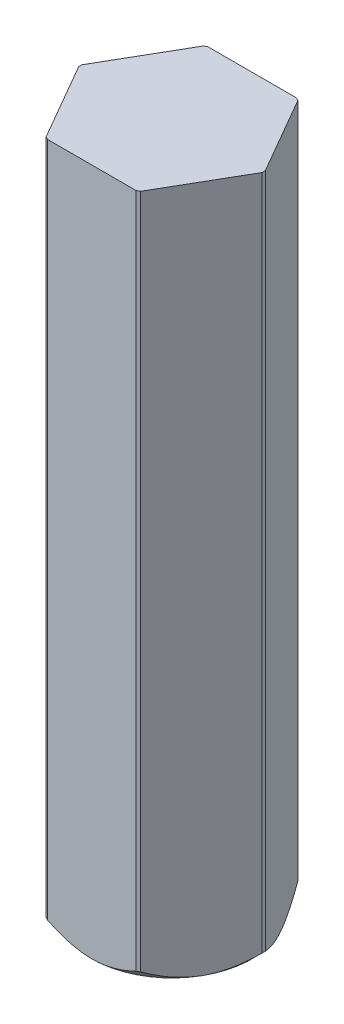
ISO-10303-21;
HEADER;
FILE_DESCRIPTION(('STEP AP214'),'2;1');
FILE_NAME('part.step','',(''),(''),'','','');
FILE_SCHEMA(('AUTOMOTIVE_DESIGN { 1 0 10303 214 1 1 1 1 }'));
ENDSEC;
DATA;
#1=APPLICATION_CONTEXT('core data for automotive mechanical design processes');
#2=APPLICATION_PROTOCOL_DEFINITION('international standard','automotive_design',2000,#1);
#3=PRODUCT_CONTEXT('',#1,'mechanical');
#4=PRODUCT('Part','Part','',(#3));
#5=PRODUCT_RELATED_PRODUCT_CATEGORY('part','',(#4));
#6=PRODUCT_DEFINITION_FORMATION('','',#4);
#7=PRODUCT_DEFINITION_CONTEXT('part definition',#1,'design');
#8=PRODUCT_DEFINITION('design','',#6,#7);
#9=PRODUCT_DEFINITION_SHAPE('','',#8);
#10=(LENGTH_UNIT() NAMED_UNIT(*) SI_UNIT(.MILLI.,.METRE.));
#11=(NAMED_UNIT(*) PLANE_ANGLE_UNIT() SI_UNIT($,.RADIAN.));
#12=(NAMED_UNIT(*) SI_UNIT($,.STERADIAN.) SOLID_ANGLE_UNIT());
#13=UNCERTAINTY_MEASURE_WITH_UNIT(LENGTH_MEASURE(1.E-05),#10,'distance_accuracy_value','');
#14=(GEOMETRIC_REPRESENTATION_CONTEXT(3) GLOBAL_UNCERTAINTY_ASSIGNED_CONTEXT((#13)) GLOBAL_UNIT_ASSIGNED_CONTEXT((#10,
#11,#12)) REPRESENTATION_CONTEXT('',''));
#15=CARTESIAN_POINT('',(0.,0.,0.));
#16=DIRECTION('',(0.,0.,1.));
#17=DIRECTION('',(1.,0.,0.));
#18=AXIS2_PLACEMENT_3D('',#15,#16,#17);
#19=CARTESIAN_POINT('',(0.,35.,0.));
#20=DIRECTION('',(0.,-1.,0.));
#21=DIRECTION('',(0.,0.,-1.));
#22=AXIS2_PLACEMENT_3D('',#19,#20,#21);
#23=CYLINDRICAL_SURFACE('',#22,4.);
#24=DIRECTION('',(0.,-1.,0.));
#25=VECTOR('',#24,1.);
#26=CARTESIAN_POINT('',(-1.93649167310371,35.,3.5));
#27=LINE('',#26,#25);
#28=CARTESIAN_POINT('',(-1.93649167310371,-5.,3.5));
#29=VERTEX_POINT('',#28);
#30=CARTESIAN_POINT('',(-1.93649167310371,-34.5,3.5));
#31=VERTEX_POINT('',#30);
#32=EDGE_CURVE('E318',#29,#31,#27,.T.);
#33=ORIENTED_EDGE('',*,*,#32,.F.);
#34=CARTESIAN_POINT('',(0.,-5.,0.));
#35=DIRECTION('',(0.,1.,0.));
#36=DIRECTION('',(0.,0.,1.));
#37=AXIS2_PLACEMENT_3D('',#34,#35,#36);
#38=CIRCLE('',#37,4.);
#39=CARTESIAN_POINT('',(-2.06284307669368,-5.,3.42705098312484));
#40=VERTEX_POINT('',#39);
#41=EDGE_CURVE('E57',#29,#40,#38,.F.);
#42=ORIENTED_EDGE('',*,*,#41,.T.);
#43=DIRECTION('',(0.,-1.,0.));
#44=VECTOR('',#43,1.);
#45=CARTESIAN_POINT('',(-2.06284307669368,35.,3.42705098312484));
#46=LINE('',#45,#44);
#47=CARTESIAN_POINT('',(-2.06284307669368,-34.5,3.42705098312484));
#48=VERTEX_POINT('',#47);
#49=EDGE_CURVE('E44',#40,#48,#46,.T.);
#50=ORIENTED_EDGE('',*,*,#49,.T.);
#51=CARTESIAN_POINT('',(0.,-34.5,0.));
#52=DIRECTION('',(0.,-1.,0.));
#53=DIRECTION('',(0.,0.,1.));
#54=AXIS2_PLACEMENT_3D('',#51,#52,#53);
#55=CIRCLE('',#54,4.);
#56=EDGE_CURVE('E342',#31,#48,#55,.T.);
#57=ORIENTED_EDGE('',*,*,#56,.F.);
#58=EDGE_LOOP('',(#33,#42,#50,#57));
#59=FACE_BOUND('',#58,.T.);
#60=ADVANCED_FACE('F40',(#59),#23,.T.);
#61=CARTESIAN_POINT('',(-3.03108891324554,35.,1.75));
#62=DIRECTION('',(0.866025403784439,0.,-0.5));
#63=DIRECTION('',(0.,-1.,0.));
#64=AXIS2_PLACEMENT_3D('',#61,#62,#63);
#65=PLANE('',#64);
#66=DIRECTION('',(0.5,0.,0.866025403784439));
#67=VECTOR('',#66,1.);
#68=CARTESIAN_POINT('',(-3.03108891324554,-5.,1.75));
#69=LINE('',#68,#67);
#70=CARTESIAN_POINT('',(-3.99933474979739,-5.,0.0729490168751557));
#71=VERTEX_POINT('',#70);
#72=EDGE_CURVE('E547',#71,#40,#69,.T.);
#73=ORIENTED_EDGE('',*,*,#72,.F.);
#74=DIRECTION('',(0.,-1.,0.));
#75=VECTOR('',#74,1.);
#76=CARTESIAN_POINT('',(-3.99933474979739,35.,0.0729490168751557));
#77=LINE('',#76,#75);
#78=CARTESIAN_POINT('',(-3.99933474979739,-34.5,0.0729490168751558));
#79=VERTEX_POINT('',#78);
#80=EDGE_CURVE('E524',#71,#79,#77,.T.);
#81=ORIENTED_EDGE('',*,*,#80,.T.);
#82=CARTESIAN_POINT('',(-3.03108891324554,-35.,1.75));
#83=CARTESIAN_POINT('',(-3.05882347043528,-35.000012992353,1.70195087477957));
#84=CARTESIAN_POINT('',(-3.08656290483721,-34.9986857060194,1.6539071075598));
#85=CARTESIAN_POINT('',(-3.14205317875729,-34.9934019445432,1.55781783907712));
#86=CARTESIAN_POINT('',(-3.16980388876424,-34.9894392297186,1.50977260493846));
#87=CARTESIAN_POINT('',(-3.22543575008031,-34.9788890801331,1.41346481986221));
#88=CARTESIAN_POINT('',(-3.25331581985047,-34.9722782906641,1.36520421825151));
#89=CARTESIAN_POINT('',(-3.30847097354385,-34.9566808577687,1.26967214797738));
#90=CARTESIAN_POINT('',(-3.33574896907726,-34.9477300402558,1.22239648145921));
#91=CARTESIAN_POINT('',(-3.39033713188932,-34.9274084507866,1.1277987291334));
#92=CARTESIAN_POINT('',(-3.41764536755044,-34.9160165670169,1.08048007530086));
#93=CARTESIAN_POINT('',(-3.47240211435411,-34.890823959931,0.985624830789243));
#94=CARTESIAN_POINT('',(-3.49984709002831,-34.8769912595016,0.938094723864765));
#95=CARTESIAN_POINT('',(-3.55307021121838,-34.8479655583388,0.845894554429295));
#96=CARTESIAN_POINT('',(-3.57886301445262,-34.8328753357736,0.801200440291754));
#97=CARTESIAN_POINT('',(-3.63054121529228,-34.8007004073574,0.711643730418149));
#98=CARTESIAN_POINT('',(-3.65642256025621,-34.7835900201002,0.666788041017114));
#99=CARTESIAN_POINT('',(-3.70835418779817,-34.7473768530761,0.576803546596445));
#100=CARTESIAN_POINT('',(-3.73439941904859,-34.7282442930395,0.531683842656063));
#101=CARTESIAN_POINT('',(-3.78672055298625,-34.6879909826448,0.44106622757434));
#102=CARTESIAN_POINT('',(-3.8129903763939,-34.6668377140399,0.39557928307146));
#103=CARTESIAN_POINT('',(-3.86581274253368,-34.6225458136387,0.304127980921372));
#104=CARTESIAN_POINT('',(-3.89235822934556,-34.599373085296,0.258176115161038));
#105=CARTESIAN_POINT('',(-3.94577519677953,-34.5510406475558,0.165698953480692));
#106=CARTESIAN_POINT('',(-3.97263871730488,-34.5258461551896,0.119187213540123));
#107=CARTESIAN_POINT('',(-3.99933474979739,-34.5,0.0729490168751653));
#108=B_SPLINE_CURVE_WITH_KNOTS('',3,(#82,#83,#84,#85,#86,#87,#88,#89,#90,#91,#92,#93,#94,#95,
#96,#97,#98,#99,#100,#101,#102,#103,#104,#105,#106,#107),.UNSPECIFIED.,.F.,.F.,(4,2,2,2,2,2,2,2,
2,2,2,2,4),(0.,0.166417445521901,0.333230313004929,0.501547972522528,0.667425936371824,
0.834801005707492,1.00455831221987,1.16581653297835,1.3294061767491,1.49587667837163,
1.66573234995728,1.83943197497432,2.01738955955198),.UNSPECIFIED.);
#109=CARTESIAN_POINT('',(-3.03108891324554,-35.,1.75));
#110=VERTEX_POINT('',#109);
#111=EDGE_CURVE('E387',#110,#79,#108,.T.);
#112=ORIENTED_EDGE('',*,*,#111,.F.);
#113=CARTESIAN_POINT('',(-2.06284307669368,-34.5,3.42705098312485));
#114=CARTESIAN_POINT('',(-2.10235976218926,-34.5382590676297,3.35859880058728));
#115=CARTESIAN_POINT('',(-2.14222266408614,-34.5750989658799,3.28952226789693));
#116=CARTESIAN_POINT('',(-2.22131903853511,-34.6441772896961,3.15246272552182));
#117=CARTESIAN_POINT('',(-2.26052767047603,-34.6765297388128,3.08452266503771));
#118=CARTESIAN_POINT('',(-2.33851441025292,-34.7366492821824,2.94943701913404));
#119=CARTESIAN_POINT('',(-2.37727113350339,-34.7645234380977,2.88232705963171));
#120=CARTESIAN_POINT('',(-2.45454889347005,-34.8156827674292,2.7485572686258));
#121=CARTESIAN_POINT('',(-2.49305406478479,-34.8390603897438,2.6819239216714));
#122=CARTESIAN_POINT('',(-2.55282667190896,-34.8718810857713,2.57836353190025));
#123=CARTESIAN_POINT('',(-2.57391726392261,-34.8828045851941,2.54179911961575));
#124=CARTESIAN_POINT('',(-2.61590415847259,-34.9031789680531,2.46896802094185));
#125=CARTESIAN_POINT('',(-2.63679821370228,-34.9126505153656,2.43270585290638));
#126=CARTESIAN_POINT('',(-2.6784596624698,-34.9301177420864,2.36041423925251));
#127=CARTESIAN_POINT('',(-2.69922512799228,-34.938131134779,2.32438797074215));
#128=CARTESIAN_POINT('',(-2.74068543910686,-34.9526868725839,2.25249325967223));
#129=CARTESIAN_POINT('',(-2.76137890788573,-34.959243151391,2.21662685203637));
#130=CARTESIAN_POINT('',(-2.80274748886846,-34.9708881765737,2.14497154289784));
#131=CARTESIAN_POINT('',(-2.82342179710193,-34.9759864505999,2.10918372907991));
#132=CARTESIAN_POINT('',(-2.86479773676806,-34.9847205161798,2.03759875346476));
#133=CARTESIAN_POINT('',(-2.88549907267484,-34.9883609030095,2.00180198265507));
#134=CARTESIAN_POINT('',(-2.92696889475356,-34.9941830482885,1.93010665340676));
#135=CARTESIAN_POINT('',(-2.94773740753644,-34.9963641318886,1.89420805557413));
#136=CARTESIAN_POINT('',(-2.98937260410892,-34.9992775571441,1.8222095910194));
#137=CARTESIAN_POINT('',(-3.01023933738633,-35.0000038442928,1.78610950760279));
#138=CARTESIAN_POINT('',(-3.03108891324554,-35.,1.75));
#139=B_SPLINE_CURVE_WITH_KNOTS('',3,(#113,#114,#115,#116,#117,#118,#119,#120,#121,#122,#123,
#124,#125,#126,#127,#128,#129,#130,#131,#132,#133,#134,#135,#136,#137,#138),.UNSPECIFIED.,.F.,
.F.,(4,2,2,2,2,2,2,2,2,2,2,2,4),(0.,0.263458815209974,0.517939845110757,0.764918588294813,
1.00609323218632,1.13688044266655,1.2655868750523,1.39260674712163,1.51835404040422,
1.64325978427744,1.76776866524313,1.89233508513907,2.01741885174986),.UNSPECIFIED.);
#140=EDGE_CURVE('E376',#48,#110,#139,.T.);
#141=ORIENTED_EDGE('',*,*,#140,.F.);
#142=ORIENTED_EDGE('',*,*,#49,.F.);
#143=EDGE_LOOP('',(#73,#81,#112,#141,#142));
#144=FACE_BOUND('',#143,.T.);
#145=ADVANCED_FACE('F244',(#144),#65,.F.);
#146=CARTESIAN_POINT('',(0.,35.,0.));
#147=DIRECTION('',(0.,-1.,0.));
#148=DIRECTION('',(0.,0.,-1.));
#149=AXIS2_PLACEMENT_3D('',#146,#147,#148);
#150=CYLINDRICAL_SURFACE('',#149,4.);
#151=ORIENTED_EDGE('',*,*,#80,.F.);
#152=CARTESIAN_POINT('',(-3.99933474979739,-5.,-0.0729490168751561));
#153=VERTEX_POINT('',#152);
#154=EDGE_CURVE('E600',#71,#153,#38,.F.);
#155=ORIENTED_EDGE('',*,*,#154,.T.);
#156=DIRECTION('',(0.,-1.,0.));
#157=VECTOR('',#156,1.);
#158=CARTESIAN_POINT('',(-3.99933474979739,35.,-0.0729490168751594));
#159=LINE('',#158,#157);
#160=CARTESIAN_POINT('',(-3.99933474979739,-34.5,-0.0729490168751594));
#161=VERTEX_POINT('',#160);
#162=EDGE_CURVE('E522',#153,#161,#159,.T.);
#163=ORIENTED_EDGE('',*,*,#162,.T.);
#164=CARTESIAN_POINT('',(0.,-34.5,0.));
#165=DIRECTION('',(0.,-1.,0.));
#166=DIRECTION('',(0.,0.,1.));
#167=AXIS2_PLACEMENT_3D('',#164,#165,#166);
#168=CIRCLE('',#167,4.);
#169=EDGE_CURVE('E538',#79,#161,#168,.T.);
#170=ORIENTED_EDGE('',*,*,#169,.F.);
#171=EDGE_LOOP('',(#151,#155,#163,#170));
#172=FACE_BOUND('',#171,.T.);
#173=ADVANCED_FACE('F500',(#172),#150,.T.);
#174=CARTESIAN_POINT('',(-3.03108891324554,35.,-1.75));
#175=DIRECTION('',(0.866025403784439,0.,0.5));
#176=DIRECTION('',(0.,-1.,0.));
#177=AXIS2_PLACEMENT_3D('',#174,#175,#176);
#178=PLANE('',#177);
#179=DIRECTION('',(-0.5,0.,0.866025403784439));
#180=VECTOR('',#179,1.);
#181=CARTESIAN_POINT('',(-3.03108891324554,-5.,-1.75));
#182=LINE('',#181,#180);
#183=CARTESIAN_POINT('',(-2.06284307669368,-5.,-3.42705098312484));
#184=VERTEX_POINT('',#183);
#185=EDGE_CURVE('E588',#184,#153,#182,.T.);
#186=ORIENTED_EDGE('',*,*,#185,.F.);
#187=DIRECTION('',(0.,-1.,0.));
#188=VECTOR('',#187,1.);
#189=CARTESIAN_POINT('',(-2.06284307669368,35.,-3.42705098312484));
#190=LINE('',#189,#188);
#191=CARTESIAN_POINT('',(-2.06284307669368,-34.5,-3.42705098312484));
#192=VERTEX_POINT('',#191);
#193=EDGE_CURVE('E519',#184,#192,#190,.T.);
#194=ORIENTED_EDGE('',*,*,#193,.T.);
#195=CARTESIAN_POINT('',(-3.03108891324554,-35.,-1.75));
#196=CARTESIAN_POINT('',(-3.00334442877006,-35.0000129923529,-1.79804339369915));
#197=CARTESIAN_POINT('',(-2.97560702306524,-34.9986857060194,-1.84608833218758));
#198=CARTESIAN_POINT('',(-2.92013641248821,-34.9934019445432,-1.94218895330652));
#199=CARTESIAN_POINT('',(-2.8924033741968,-34.9894392297187,-1.99024439021491));
#200=CARTESIAN_POINT('',(-2.8368143163967,-34.978889080133,-2.08657688791276));
#201=CARTESIAN_POINT('',(-2.80895944428514,-34.9722782906638,-2.13485203739857));
#202=CARTESIAN_POINT('',(-2.75380382138843,-34.9566808577664,-2.23038383679936));
#203=CARTESIAN_POINT('',(-2.72650089095959,-34.9477300402512,-2.27764510717));
#204=CARTESIAN_POINT('',(-2.67187091569919,-34.9274084507794,-2.37221871908872));
#205=CARTESIAN_POINT('',(-2.6445458772364,-34.9160165670103,-2.4195276718195));
#206=CARTESIAN_POINT('',(-2.58977719921861,-34.8908239599265,-2.51437602782028));
#207=CARTESIAN_POINT('',(-2.56233740702558,-34.8769912594992,-2.56190912740775));
#208=CARTESIAN_POINT('',(-2.50910127866452,-34.8479655583332,-2.65410178714129));
#209=CARTESIAN_POINT('',(-2.48329144203616,-34.8328753357615,-2.69878606705683));
#210=CARTESIAN_POINT('',(-2.43157215662025,-34.8007004073354,-2.78831905676012));
#211=CARTESIAN_POINT('',(-2.40566666257347,-34.783590020075,-2.83316080368989));
#212=CARTESIAN_POINT('',(-2.3537036182245,-34.7473768530463,-2.92312715961982));
#213=CARTESIAN_POINT('',(-2.3276514240243,-34.7282442930086,-2.96824284350235));
#214=CARTESIAN_POINT('',(-2.27533483430013,-34.6879909826139,-3.05886308218772));
#215=CARTESIAN_POINT('',(-2.24907689652383,-34.6668377140103,-3.1043568888608));
#216=CARTESIAN_POINT('',(-2.19628892872484,-34.6225458136139,-3.19582805089198));
#217=CARTESIAN_POINT('',(-2.16976618903338,-34.5993730852748,-3.2417930497005));
#218=CARTESIAN_POINT('',(-2.11638710147309,-34.551040647544,-3.33429208131434));
#219=CARTESIAN_POINT('',(-2.08953851337845,-34.5258461551838,-3.380812442484));
#220=CARTESIAN_POINT('',(-2.06284307669368,-34.5,-3.42705098312484));
#221=B_SPLINE_CURVE_WITH_KNOTS('',3,(#195,#196,#197,#198,#199,#200,#201,#202,#203,#204,#205,
#206,#207,#208,#209,#210,#211,#212,#213,#214,#215,#216,#217,#218,#219,#220),.UNSPECIFIED.,.F.,
.F.,(4,2,2,2,2,2,2,2,2,2,2,2,4),(0.,0.166417445521458,0.333230313004491,0.501547972522537,
0.667425936427033,0.83480100576302,1.00455831222016,1.16581653301574,1.32940617680989,
1.49587667844113,1.66573235001991,1.83943197501379,2.01738955955139),.UNSPECIFIED.);
#222=CARTESIAN_POINT('',(-3.03108891324553,-35.,-1.75));
#223=VERTEX_POINT('',#222);
#224=EDGE_CURVE('E395',#223,#192,#221,.T.);
#225=ORIENTED_EDGE('',*,*,#224,.F.);
#226=CARTESIAN_POINT('',(-3.99933474979739,-34.5,-0.0729490168751578));
#227=CARTESIAN_POINT('',(-3.959811763515,-34.5382590676375,-0.141397561670559));
#228=CARTESIAN_POINT('',(-3.91992118233897,-34.5750989658961,-0.210458113740246));
#229=CARTESIAN_POINT('',(-3.840772324022,-34.6441772897231,-0.347487354564375));
#230=CARTESIAN_POINT('',(-3.80153882167441,-34.6765297388427,-0.415413056118003));
#231=CARTESIAN_POINT('',(-3.72354459052158,-34.7366492822126,-0.550494376872731));
#232=CARTESIAN_POINT('',(-3.68480402237301,-34.7645234381257,-0.617613663520729));
#233=CARTESIAN_POINT('',(-3.60759486509911,-34.8156827674461,-0.751423062285646));
#234=CARTESIAN_POINT('',(-3.56914127956547,-34.8390603897523,-0.81808619228705));
#235=CARTESIAN_POINT('',(-3.50934165476894,-34.8718810857715,-0.921630983390757));
#236=CARTESIAN_POINT('',(-3.48822124086059,-34.8828045851939,-0.95817817800713));
#237=CARTESIAN_POINT('',(-3.44614110649359,-34.9031789680526,-1.030955444666));
#238=CARTESIAN_POINT('',(-3.42518417539093,-34.9126505153653,-1.06718131130689));
#239=CARTESIAN_POINT('',(-3.38340852586549,-34.9301177420862,-1.13940699113463));
#240=CARTESIAN_POINT('',(-3.36259159489133,-34.9381311347788,-1.17540354605719));
#241=CARTESIAN_POINT('',(-3.32105910426129,-34.9526868725837,-1.24725658427054));
#242=CARTESIAN_POINT('',(-3.30034461849443,-34.9592431513908,-1.28311085774424));
#243=CARTESIAN_POINT('',(-3.25897359095449,-34.9708881765735,-1.3547647543623));
#244=CARTESIAN_POINT('',(-3.23831758915885,-34.9759864505998,-1.3905631374055));
#245=CARTESIAN_POINT('',(-3.19701115158085,-34.9847205161797,-1.46218824006381));
#246=CARTESIAN_POINT('',(-3.17636090664069,-34.9883609030095,-1.49801450825224));
#247=CARTESIAN_POINT('',(-3.13500584122199,-34.9941830482884,-1.56977609227686));
#248=CARTESIAN_POINT('',(-3.11430099993272,-34.9963641318885,-1.60571145085581));
#249=CARTESIAN_POINT('',(-3.07276609888797,-34.9992775571441,-1.67776782104212));
#250=CARTESIAN_POINT('',(-3.05193587621346,-35.0000038442928,-1.71388898385442));
#251=CARTESIAN_POINT('',(-3.03108891324554,-35.,-1.75));
#252=B_SPLINE_CURVE_WITH_KNOTS('',3,(#226,#227,#228,#229,#230,#231,#232,#233,#234,#235,#236,
#237,#238,#239,#240,#241,#242,#243,#244,#245,#246,#247,#248,#249,#250,#251),.UNSPECIFIED.,.F.,
.F.,(4,2,2,2,2,2,2,2,2,2,2,2,4),(0.,0.263458815264295,0.517939845181636,0.764918588346855,
1.00609323218719,1.13688044269435,1.26558687509948,1.39260674718052,1.51835404046703,
1.64325978433631,1.76776866529012,1.89233508516621,2.01741885174918),.UNSPECIFIED.);
#253=EDGE_CURVE('E521',#161,#223,#252,.T.);
#254=ORIENTED_EDGE('',*,*,#253,.F.);
#255=ORIENTED_EDGE('',*,*,#162,.F.);
#256=EDGE_LOOP('',(#186,#194,#225,#254,#255));
#257=FACE_BOUND('',#256,.T.);
#258=ADVANCED_FACE('F492',(#257),#178,.F.);
#259=CARTESIAN_POINT('',(0.,35.,0.));
#260=DIRECTION('',(0.,-1.,0.));
#261=DIRECTION('',(0.,0.,-1.));
#262=AXIS2_PLACEMENT_3D('',#259,#260,#261);
#263=CYLINDRICAL_SURFACE('',#262,4.);
#264=ORIENTED_EDGE('',*,*,#193,.F.);
#265=CARTESIAN_POINT('',(-1.93649167310371,-5.,-3.5));
#266=VERTEX_POINT('',#265);
#267=EDGE_CURVE('E606',#184,#266,#38,.F.);
#268=ORIENTED_EDGE('',*,*,#267,.T.);
#269=DIRECTION('',(0.,-1.,0.));
#270=VECTOR('',#269,1.);
#271=CARTESIAN_POINT('',(-1.9364916731037,35.,-3.5));
#272=LINE('',#271,#270);
#273=CARTESIAN_POINT('',(-1.9364916731037,-34.5,-3.5));
#274=VERTEX_POINT('',#273);
#275=EDGE_CURVE('E436',#266,#274,#272,.T.);
#276=ORIENTED_EDGE('',*,*,#275,.T.);
#277=CARTESIAN_POINT('',(0.,-34.5,0.));
#278=DIRECTION('',(0.,-1.,0.));
#279=DIRECTION('',(0.,0.,1.));
#280=AXIS2_PLACEMENT_3D('',#277,#278,#279);
#281=CIRCLE('',#280,4.);
#282=EDGE_CURVE('E517',#192,#274,#281,.T.);
#283=ORIENTED_EDGE('',*,*,#282,.F.);
#284=EDGE_LOOP('',(#264,#268,#276,#283));
#285=FACE_BOUND('',#284,.T.);
#286=ADVANCED_FACE('F207',(#285),#263,.T.);
#287=CARTESIAN_POINT('',(0.,35.,-3.5));
#288=DIRECTION('',(0.,0.,1.));
#289=DIRECTION('',(1.,0.,0.));
#290=AXIS2_PLACEMENT_3D('',#287,#288,#289);
#291=PLANE('',#290);
#292=DIRECTION('',(-1.,0.,0.));
#293=VECTOR('',#292,1.);
#294=CARTESIAN_POINT('',(0.,-5.,-3.5));
#295=LINE('',#294,#293);
#296=CARTESIAN_POINT('',(1.93649167310371,-5.,-3.5));
#297=VERTEX_POINT('',#296);
#298=EDGE_CURVE('E591',#297,#266,#295,.T.);
#299=ORIENTED_EDGE('',*,*,#298,.F.);
#300=DIRECTION('',(0.,-1.,0.));
#301=VECTOR('',#300,1.);
#302=CARTESIAN_POINT('',(1.93649167310371,35.,-3.5));
#303=LINE('',#302,#301);
#304=CARTESIAN_POINT('',(1.93649167310371,-34.5,-3.5));
#305=VERTEX_POINT('',#304);
#306=EDGE_CURVE('E441',#297,#305,#303,.T.);
#307=ORIENTED_EDGE('',*,*,#306,.T.);
#308=CARTESIAN_POINT('',(0.,-35.,-3.5));
#309=CARTESIAN_POINT('',(0.0557968565673497,-35.0000132857336,-3.49999413761611));
#310=CARTESIAN_POINT('',(0.111591523762407,-34.9986719222572,-3.4999940716728));
#311=CARTESIAN_POINT('',(0.223176431484664,-34.9933313042747,-3.50000229594598));
#312=CARTESIAN_POINT('',(0.27896639462067,-34.9893262343549,-3.50001060446613));
#313=CARTESIAN_POINT('',(0.390792092558374,-34.9786627683359,-3.50003243496287));
#314=CARTESIAN_POINT('',(0.44682559109981,-34.9719810593164,-3.50004600271163));
#315=CARTESIAN_POINT('',(0.557358551855963,-34.9562675002696,-3.50004571319773));
#316=CARTESIAN_POINT('',(0.611865498242669,-34.9472880133662,-3.50003242652539));
#317=CARTESIAN_POINT('',(0.720947444970029,-34.9269135509148,-3.5000113776472));
#318=CARTESIAN_POINT('',(0.775518400952097,-34.9154969762429,-3.50000366774149));
#319=CARTESIAN_POINT('',(0.884930424343704,-34.8902597636004,-3.49999964524661));
#320=CARTESIAN_POINT('',(0.939764000659093,-34.8764067712764,-3.50000349895542));
#321=CARTESIAN_POINT('',(1.04605141154136,-34.8473676886215,-3.49999668088105));
#322=CARTESIAN_POINT('',(1.09753410308348,-34.8322867108048,-3.49998674548697));
#323=CARTESIAN_POINT('',(1.20069190049306,-34.8001396964779,-3.49996313853742));
#324=CARTESIAN_POINT('',(1.25235903096708,-34.7830481175632,-3.49994941505281));
#325=CARTESIAN_POINT('',(1.35601354195282,-34.7468822735059,-3.49993152773033));
#326=CARTESIAN_POINT('',(1.40799057343951,-34.7277784248813,-3.49992753626595));
#327=CARTESIAN_POINT('',(1.51238577221617,-34.6875921042016,-3.49993011527844));
#328=CARTESIAN_POINT('',(1.56479148337895,-34.6664773443854,-3.49993690175595));
#329=CARTESIAN_POINT('',(1.67015510990311,-34.6222720172309,-3.49995653644773));
#330=CARTESIAN_POINT('',(1.72309877939983,-34.5991476043317,-3.49996951806082));
#331=CARTESIAN_POINT('',(1.82964230392194,-34.5509213609417,-3.49999113528789));
#332=CARTESIAN_POINT('',(1.88322655350134,-34.5257850067186,-3.49999965688349));
#333=CARTESIAN_POINT('',(1.93649167310371,-34.5,-3.5));
#334=B_SPLINE_CURVE_WITH_KNOTS('',3,(#308,#309,#310,#311,#312,#313,#314,#315,#316,#317,#318,
#319,#320,#321,#322,#323,#324,#325,#326,#327,#328,#329,#330,#331,#332,#333),.UNSPECIFIED.,.F.,
.F.,(4,2,2,2,2,2,2,2,2,2,2,2,4),(0.,0.167370637129168,0.335107883208693,0.50433900154368,
0.670012179969559,0.837219614922354,1.00684315281957,1.16774851920198,1.33097972141052,
1.49708172378944,1.66655479750955,1.83985412937255,2.01739056930095),.UNSPECIFIED.);
#335=CARTESIAN_POINT('',(0.,-35.,-3.5));
#336=VERTEX_POINT('',#335);
#337=EDGE_CURVE('E438',#336,#305,#334,.T.);
#338=ORIENTED_EDGE('',*,*,#337,.F.);
#339=CARTESIAN_POINT('',(-1.93649167310371,-34.5,-3.5));
#340=CARTESIAN_POINT('',(-1.85720513623371,-34.5383784972207,-3.49999633243831));
#341=CARTESIAN_POINT('',(-1.77720025237538,-34.5753292166729,-3.49998009681744));
#342=CARTESIAN_POINT('',(-1.61846028817863,-34.6445989758941,-3.49994931292403));
#343=CARTESIAN_POINT('',(-1.53977529608293,-34.677033169314,-3.49993472594244));
#344=CARTESIAN_POINT('',(-1.3833129487189,-34.7372861560812,-3.49993037507804));
#345=CARTESIAN_POINT('',(-1.30557749773499,-34.7652130251524,-3.4999398903011));
#346=CARTESIAN_POINT('',(-1.15061447608758,-34.8164479440911,-3.4999799756822));
#347=CARTESIAN_POINT('',(-1.07341797883865,-34.8398491967691,-3.50001004525346));
#348=CARTESIAN_POINT('',(-0.953730656063979,-34.8726128431183,-3.49999458553019));
#349=CARTESIAN_POINT('',(-0.911646108768552,-34.8834739518434,-3.49997751652475));
#350=CARTESIAN_POINT('',(-0.827829031057503,-34.9037320164544,-3.49992422666346));
#351=CARTESIAN_POINT('',(-0.786101472684562,-34.9131494265489,-3.49988831322956));
#352=CARTESIAN_POINT('',(-0.702909001097892,-34.9305169040496,-3.49982308678393));
#353=CARTESIAN_POINT('',(-0.66144775366574,-34.9384844972271,-3.49979369384204));
#354=CARTESIAN_POINT('',(-0.578695756839846,-34.9529571133399,-3.49975247840488));
#355=CARTESIAN_POINT('',(-0.537407424451548,-34.9594759173408,-3.49974048376825));
#356=CARTESIAN_POINT('',(-0.4549063500402,-34.9710544384025,-3.49973910407234));
#357=CARTESIAN_POINT('',(-0.413694932944503,-34.9761235751259,-3.49974956910782));
#358=CARTESIAN_POINT('',(-0.331250443822006,-34.984807758452,-3.49978927937735));
#359=CARTESIAN_POINT('',(-0.290017850999335,-34.9884273455984,-3.49981846521134));
#360=CARTESIAN_POINT('',(-0.207431881314215,-34.9942162419974,-3.49988401288001));
#361=CARTESIAN_POINT('',(-0.166078457460158,-34.9963848806206,-3.49992037802292));
#362=CARTESIAN_POINT('',(-0.0831500248701011,-34.9992816547201,-3.49997765784509));
#363=CARTESIAN_POINT('',(-0.0415748066058705,-35.0000038008175,-3.49999850806005));
#364=CARTESIAN_POINT('',(0.,-35.,-3.5));
#365=B_SPLINE_CURVE_WITH_KNOTS('',3,(#339,#340,#341,#342,#343,#344,#345,#346,#347,#348,#349,
#350,#351,#352,#353,#354,#355,#356,#357,#358,#359,#360,#361,#362,#363,#364),.UNSPECIFIED.,.F.,
.F.,(4,2,2,2,2,2,2,2,2,2,2,2,4),(0.,0.264281892312861,0.519529205529767,0.76723279993538,
1.00910912728711,1.13948235064916,1.26779195879195,1.39442914749632,1.51980461566066,
1.64434587907272,1.76849392162994,1.89269930591752,2.01741792335134),.UNSPECIFIED.);
#366=EDGE_CURVE('E426',#274,#336,#365,.T.);
#367=ORIENTED_EDGE('',*,*,#366,.F.);
#368=ORIENTED_EDGE('',*,*,#275,.F.);
#369=EDGE_LOOP('',(#299,#307,#338,#367,#368));
#370=FACE_BOUND('',#369,.T.);
#371=ADVANCED_FACE('F268',(#370),#291,.F.);
#372=CARTESIAN_POINT('',(0.,35.,0.));
#373=DIRECTION('',(0.,-1.,0.));
#374=DIRECTION('',(0.,0.,-1.));
#375=AXIS2_PLACEMENT_3D('',#372,#373,#374);
#376=CYLINDRICAL_SURFACE('',#375,4.);
#377=ORIENTED_EDGE('',*,*,#306,.F.);
#378=CARTESIAN_POINT('',(2.06284307669368,-5.,-3.42705098312484));
#379=VERTEX_POINT('',#378);
#380=EDGE_CURVE('E612',#297,#379,#38,.F.);
#381=ORIENTED_EDGE('',*,*,#380,.T.);
#382=DIRECTION('',(0.,-1.,0.));
#383=VECTOR('',#382,1.);
#384=CARTESIAN_POINT('',(2.06284307669369,35.,-3.42705098312484));
#385=LINE('',#384,#383);
#386=CARTESIAN_POINT('',(2.06284307669369,-34.5,-3.42705098312484));
#387=VERTEX_POINT('',#386);
#388=EDGE_CURVE('E454',#379,#387,#385,.T.);
#389=ORIENTED_EDGE('',*,*,#388,.T.);
#390=CARTESIAN_POINT('',(0.,-34.5,0.));
#391=DIRECTION('',(0.,-1.,0.));
#392=DIRECTION('',(0.,0.,1.));
#393=AXIS2_PLACEMENT_3D('',#390,#391,#392);
#394=CIRCLE('',#393,4.);
#395=EDGE_CURVE('E446',#305,#387,#394,.T.);
#396=ORIENTED_EDGE('',*,*,#395,.F.);
#397=EDGE_LOOP('',(#377,#381,#389,#396));
#398=FACE_BOUND('',#397,.T.);
#399=ADVANCED_FACE('F209',(#398),#376,.T.);
#400=CARTESIAN_POINT('',(3.03108891324554,35.,-1.75));
#401=DIRECTION('',(-0.866025403784439,0.,0.5));
#402=DIRECTION('',(0.,1.,0.));
#403=AXIS2_PLACEMENT_3D('',#400,#401,#402);
#404=PLANE('',#403);
#405=DIRECTION('',(-0.5,0.,-0.866025403784439));
#406=VECTOR('',#405,1.);
#407=CARTESIAN_POINT('',(3.03108891324554,-5.,-1.75));
#408=LINE('',#407,#406);
#409=CARTESIAN_POINT('',(3.99933474979739,-5.,-0.0729490168751624));
#410=VERTEX_POINT('',#409);
#411=EDGE_CURVE('E594',#410,#379,#408,.T.);
#412=ORIENTED_EDGE('',*,*,#411,.F.);
#413=DIRECTION('',(0.,-1.,0.));
#414=VECTOR('',#413,1.);
#415=CARTESIAN_POINT('',(3.99933474979739,35.,-0.0729490168751624));
#416=LINE('',#415,#414);
#417=CARTESIAN_POINT('',(3.99933474979739,-34.5,-0.0729490168751624));
#418=VERTEX_POINT('',#417);
#419=EDGE_CURVE('E802',#410,#418,#416,.T.);
#420=ORIENTED_EDGE('',*,*,#419,.T.);
#421=CARTESIAN_POINT('',(3.03108891324553,-35.,-1.75));
#422=CARTESIAN_POINT('',(3.05882347043503,-35.0000129923529,-1.70195087478014));
#423=CARTESIAN_POINT('',(3.08656290483668,-34.9986857060194,-1.65390710756089));
#424=CARTESIAN_POINT('',(3.14205317875647,-34.9934019445432,-1.55781783907873));
#425=CARTESIAN_POINT('',(3.16980388876343,-34.9894392297186,-1.50977260494007));
#426=CARTESIAN_POINT('',(3.22543575007992,-34.978889080133,-1.41346481986339));
#427=CARTESIAN_POINT('',(3.2533158198505,-34.9722782906638,-1.36520421825227));
#428=CARTESIAN_POINT('',(3.3084709735514,-34.9566808577668,-1.26967214796355));
#429=CARTESIAN_POINT('',(3.33574896909186,-34.9477300402519,-1.22239648143131));
#430=CARTESIAN_POINT('',(3.39033713190987,-34.9274084507806,-1.12779872909066));
#431=CARTESIAN_POINT('',(3.41764536756994,-34.9160165670115,-1.08048007525726));
#432=CARTESIAN_POINT('',(3.47240211436618,-34.8908239599273,-0.985624830759577));
#433=CARTESIAN_POINT('',(3.49984709003412,-34.8769912594996,-0.938094723849801));
#434=CARTESIAN_POINT('',(3.55307021122541,-34.8479655583338,-0.845894554421823));
#435=CARTESIAN_POINT('',(3.57886301446696,-34.8328753357629,-0.801200440277259));
#436=CARTESIAN_POINT('',(3.63054121531744,-34.8007004073379,-0.711643730391415));
#437=CARTESIAN_POINT('',(3.65642256028486,-34.7835900200779,-0.666788040985102));
#438=CARTESIAN_POINT('',(3.70835418783106,-34.7473768530497,-0.576803546556916));
#439=CARTESIAN_POINT('',(3.73439941908224,-34.7282442930121,-0.531683842614243));
#440=CARTESIAN_POINT('',(3.78672055301883,-34.6879909826174,-0.441066227531225));
#441=CARTESIAN_POINT('',(3.81299037642466,-34.6668377140137,-0.395579283029288));
#442=CARTESIAN_POINT('',(3.8658127425586,-34.6225458136167,-0.304127980884893));
#443=CARTESIAN_POINT('',(3.89235822936648,-34.5993730852772,-0.258176115129263));
#444=CARTESIAN_POINT('',(3.94577519679064,-34.5510406475453,-0.165698953462553));
#445=CARTESIAN_POINT('',(3.9726387173102,-34.5258461551844,-0.119187213530877));
#446=CARTESIAN_POINT('',(3.99933474979739,-34.5,-0.0729490168751497));
#447=B_SPLINE_CURVE_WITH_KNOTS('',3,(#421,#422,#423,#424,#425,#426,#427,#428,#429,#430,#431,
#432,#433,#434,#435,#436,#437,#438,#439,#440,#441,#442,#443,#444,#445,#446),.UNSPECIFIED.,.F.,
.F.,(4,2,2,2,2,2,2,2,2,2,2,2,4),(0.,0.166417445520097,0.333230313003132,0.501547972522535,
0.667425936419348,0.834801005755279,1.00455831222012,1.1658165330115,1.329406176803,
1.49587667843325,1.66573235001281,1.83943197500932,2.01738955955146),.UNSPECIFIED.);
#448=CARTESIAN_POINT('',(3.03108891324553,-35.,-1.75));
#449=VERTEX_POINT('',#448);
#450=EDGE_CURVE('E226',#449,#418,#447,.T.);
#451=ORIENTED_EDGE('',*,*,#450,.F.);
#452=CARTESIAN_POINT('',(2.06284307669367,-34.5,-3.42705098312485));
#453=CARTESIAN_POINT('',(2.10235976219683,-34.538259067637,-3.35859880057411));
#454=CARTESIAN_POINT('',(2.14222266410009,-34.5750989658951,-3.28952226787008));
#455=CARTESIAN_POINT('',(2.2213190385561,-34.6441772897213,-3.1524627254763));
#456=CARTESIAN_POINT('',(2.26052767049759,-34.6765297388407,-3.08452266498738));
#457=CARTESIAN_POINT('',(2.33851441027172,-34.7366492822106,-2.94943701908307));
#458=CARTESIAN_POINT('',(2.37727113351874,-34.7645234381238,-2.88232705958506));
#459=CARTESIAN_POINT('',(2.45454889347787,-34.815682767445,-2.74855726859733));
#460=CARTESIAN_POINT('',(2.49305406478835,-34.8390603897517,-2.6819239216569));
#461=CARTESIAN_POINT('',(2.55282667191526,-34.8718810857715,-2.5783635318939));
#462=CARTESIAN_POINT('',(2.57391726393545,-34.8828045851939,-2.54179911960308));
#463=CARTESIAN_POINT('',(2.61590415849579,-34.9031789680527,-2.46896802091797));
#464=CARTESIAN_POINT('',(2.6367982137293,-34.9126505153653,-2.4327058528776));
#465=CARTESIAN_POINT('',(2.67845966250259,-34.9301177420862,-2.36041423921568));
#466=CARTESIAN_POINT('',(2.69922512802702,-34.9381311347788,-2.32438797070218));
#467=CARTESIAN_POINT('',(2.74068543914371,-34.9526868725837,-2.25249325962777));
#468=CARTESIAN_POINT('',(2.76137890792273,-34.9592431513908,-2.21662685199058));
#469=CARTESIAN_POINT('',(2.80274748890423,-34.9708881765736,-2.14497154285135));
#470=CARTESIAN_POINT('',(2.82342179713632,-34.9759864505998,-2.10918372903406));
#471=CARTESIAN_POINT('',(2.86479773679838,-34.9847205161797,-2.03759875342228));
#472=CARTESIAN_POINT('',(2.88549907270247,-34.9883609030095,-2.00180198261532));
#473=CARTESIAN_POINT('',(2.92696889477471,-34.9941830482884,-1.93010665337471));
#474=CARTESIAN_POINT('',(2.94773740755381,-34.9963641318885,-1.89420805554704));
#475=CARTESIAN_POINT('',(2.98937260411788,-34.9992775571441,-1.82220959100458));
#476=CARTESIAN_POINT('',(3.01023933739065,-35.0000038442928,-1.7861095075953));
#477=CARTESIAN_POINT('',(3.03108891324553,-35.,-1.75));
#478=B_SPLINE_CURVE_WITH_KNOTS('',3,(#452,#453,#454,#455,#456,#457,#458,#459,#460,#461,#462,
#463,#464,#465,#466,#467,#468,#469,#470,#471,#472,#473,#474,#475,#476,#477),.UNSPECIFIED.,.F.,
.F.,(4,2,2,2,2,2,2,2,2,2,2,2,4),(0.,0.263458815260693,0.517939845176935,0.764918588343412,
1.00609323218715,1.13688044269252,1.26558687509636,1.39260674717662,1.51835404046286,
1.6432597843324,1.767768665287,1.89233508516441,2.01741885174923),.UNSPECIFIED.);
#479=EDGE_CURVE('E643',#387,#449,#478,.T.);
#480=ORIENTED_EDGE('',*,*,#479,.F.);
#481=ORIENTED_EDGE('',*,*,#388,.F.);
#482=EDGE_LOOP('',(#412,#420,#451,#480,#481));
#483=FACE_BOUND('',#482,.T.);
#484=ADVANCED_FACE('F232',(#483),#404,.F.);
#485=CARTESIAN_POINT('',(0.,35.,0.));
#486=DIRECTION('',(0.,-1.,0.));
#487=DIRECTION('',(0.,0.,-1.));
#488=AXIS2_PLACEMENT_3D('',#485,#486,#487);
#489=CYLINDRICAL_SURFACE('',#488,4.);
#490=ORIENTED_EDGE('',*,*,#419,.F.);
#491=CARTESIAN_POINT('',(3.99933474979739,-5.,0.0729490168751561));
#492=VERTEX_POINT('',#491);
#493=EDGE_CURVE('E608',#410,#492,#38,.F.);
#494=ORIENTED_EDGE('',*,*,#493,.T.);
#495=DIRECTION('',(0.,-1.,0.));
#496=VECTOR('',#495,1.);
#497=CARTESIAN_POINT('',(3.99933474979739,35.,0.0729490168751594));
#498=LINE('',#497,#496);
#499=CARTESIAN_POINT('',(3.99933474979739,-34.5,0.0729490168751596));
#500=VERTEX_POINT('',#499);
#501=EDGE_CURVE('E181',#492,#500,#498,.T.);
#502=ORIENTED_EDGE('',*,*,#501,.T.);
#503=CARTESIAN_POINT('',(0.,-34.5,0.));
#504=DIRECTION('',(0.,-1.,0.));
#505=DIRECTION('',(0.,0.,1.));
#506=AXIS2_PLACEMENT_3D('',#503,#504,#505);
#507=CIRCLE('',#506,4.);
#508=EDGE_CURVE('E180',#418,#500,#507,.T.);
#509=ORIENTED_EDGE('',*,*,#508,.F.);
#510=EDGE_LOOP('',(#490,#494,#502,#509));
#511=FACE_BOUND('',#510,.T.);
#512=ADVANCED_FACE('F42',(#511),#489,.T.);
#513=CARTESIAN_POINT('',(3.03108891324554,35.,1.75));
#514=DIRECTION('',(-0.866025403784439,0.,-0.5));
#515=DIRECTION('',(-0.5,0.,0.866025403784439));
#516=AXIS2_PLACEMENT_3D('',#513,#514,#515);
#517=PLANE('',#516);
#518=DIRECTION('',(0.5,0.,-0.866025403784439));
#519=VECTOR('',#518,1.);
#520=CARTESIAN_POINT('',(3.03108891324554,-5.,1.75));
#521=LINE('',#520,#519);
#522=CARTESIAN_POINT('',(2.06284307669368,-5.,3.42705098312484));
#523=VERTEX_POINT('',#522);
#524=EDGE_CURVE('E597',#523,#492,#521,.T.);
#525=ORIENTED_EDGE('',*,*,#524,.F.);
#526=DIRECTION('',(0.,-1.,0.));
#527=VECTOR('',#526,1.);
#528=CARTESIAN_POINT('',(2.06284307669368,35.,3.42705098312484));
#529=LINE('',#528,#527);
#530=CARTESIAN_POINT('',(2.06284307669368,-34.5,3.42705098312484));
#531=VERTEX_POINT('',#530);
#532=EDGE_CURVE('E178',#523,#531,#529,.T.);
#533=ORIENTED_EDGE('',*,*,#532,.T.);
#534=CARTESIAN_POINT('',(3.03108891324553,-35.,1.75));
#535=CARTESIAN_POINT('',(3.00334442876104,-35.0000129923524,1.79804339371584));
#536=CARTESIAN_POINT('',(2.97560702304521,-34.9986857060196,1.84608833222008));
#537=CARTESIAN_POINT('',(2.92013641245575,-34.9934019445439,1.94218895335404));
#538=CARTESIAN_POINT('',(2.89240337416288,-34.9894392297201,1.99024439026168));
#539=CARTESIAN_POINT('',(2.83681431637331,-34.9788890801334,2.08657688794345));
#540=CARTESIAN_POINT('',(2.80895944427373,-34.9722782906632,2.13485203741401));
#541=CARTESIAN_POINT('',(2.75380382137159,-34.9566808577591,2.23038383683279));
#542=CARTESIAN_POINT('',(2.7265008909255,-34.9477300402353,2.27764510723635));
#543=CARTESIAN_POINT('',(2.67187091564487,-34.927408450755,2.37221871918665));
#544=CARTESIAN_POINT('',(2.64454587717891,-34.9160165669874,2.41952767191634));
#545=CARTESIAN_POINT('',(2.58977719917789,-34.890823959911,2.51437602788368));
#546=CARTESIAN_POINT('',(2.56233740700468,-34.8769912594913,2.56190912743912));
#547=CARTESIAN_POINT('',(2.50910127866082,-34.8479655583279,2.65410178715229));
#548=CARTESIAN_POINT('',(2.48329144202998,-34.8328753357495,2.69878606707901));
#549=CARTESIAN_POINT('',(2.4315721566084,-34.8007004073134,2.7883190567998));
#550=CARTESIAN_POINT('',(2.40566666255836,-34.7835900200498,2.83316080373594));
#551=CARTESIAN_POINT('',(2.3537036182044,-34.7473768530166,2.92312715967423));
#552=CARTESIAN_POINT('',(2.32765142400241,-34.7282442929777,2.96824284355882));
#553=CARTESIAN_POINT('',(2.27533483427639,-34.687990982583,3.05886308224387));
#554=CARTESIAN_POINT('',(2.24907689649998,-34.6668377139807,3.10435688891463));
#555=CARTESIAN_POINT('',(2.19628892870326,-34.622545813589,3.19582805093689));
#556=CARTESIAN_POINT('',(2.16976618901415,-34.5993730852535,3.24179304973886));
#557=CARTESIAN_POINT('',(2.11638710146165,-34.5510406475322,3.33429208133542));
#558=CARTESIAN_POINT('',(2.08953851337243,-34.525846155178,3.38081244249441));
#559=CARTESIAN_POINT('',(2.06284307669369,-34.5,3.42705098312484));
#560=B_SPLINE_CURVE_WITH_KNOTS('',3,(#534,#535,#536,#537,#538,#539,#540,#541,#542,#543,#544,
#545,#546,#547,#548,#549,#550,#551,#552,#553,#554,#555,#556,#557,#558,#559),.UNSPECIFIED.,.F.,
.F.,(4,2,2,2,2,2,2,2,2,2,2,2,4),(0.,0.166417445578753,0.333230313061787,0.501547972522904,
0.667425936541519,0.834801005878519,1.00455831222051,1.16581653305318,1.32940617687074,
1.49587667851068,1.66573235008259,1.83943197505331,2.01738955955082),.UNSPECIFIED.);
#561=CARTESIAN_POINT('',(3.03108891324553,-35.,1.75));
#562=VERTEX_POINT('',#561);
#563=EDGE_CURVE('E148',#562,#531,#560,.T.);
#564=ORIENTED_EDGE('',*,*,#563,.F.);
#565=CARTESIAN_POINT('',(3.99933474979739,-34.5,0.0729490168751512));
#566=CARTESIAN_POINT('',(3.95981176350629,-34.5382590676459,0.141397561685567));
#567=CARTESIAN_POINT('',(3.91992118232038,-34.5750989659134,0.210458113769378));
#568=CARTESIAN_POINT('',(3.84077232398895,-34.6441772897519,0.347487354611115));
#569=CARTESIAN_POINT('',(3.80153882163693,-34.6765297388746,0.415413056168045));
#570=CARTESIAN_POINT('',(3.72354459048189,-34.7366492822448,0.550494376920408));
#571=CARTESIAN_POINT('',(3.68480402233563,-34.7645234381556,0.617613663562526));
#572=CARTESIAN_POINT('',(3.60759486507541,-34.8156827674642,0.751423062309615));
#573=CARTESIAN_POINT('',(3.56914127955315,-34.8390603897613,0.818086192298831));
#574=CARTESIAN_POINT('',(3.50934165476625,-34.8718810857717,0.921630983400592));
#575=CARTESIAN_POINT('',(3.48822124085539,-34.8828045851938,0.958178178027048));
#576=CARTESIAN_POINT('',(3.44614110648321,-34.9031789680522,1.03095544470258));
#577=CARTESIAN_POINT('',(3.42518417537789,-34.912650515365,1.06718131135004));
#578=CARTESIAN_POINT('',(3.38340852584778,-34.930117742086,1.1394069911881));
#579=CARTESIAN_POINT('',(3.36259159487162,-34.9381311347786,1.17540354611438));
#580=CARTESIAN_POINT('',(3.32105910423834,-34.9526868725834,1.24725658433239));
#581=CARTESIAN_POINT('',(3.30034461847026,-34.9592431513906,1.28311085780699));
#582=CARTESIAN_POINT('',(3.25897359092894,-34.9708881765733,1.35476475442424));
#583=CARTESIAN_POINT('',(3.23831758913314,-34.9759864505996,1.39056313746571));
#584=CARTESIAN_POINT('',(3.19701115155614,-34.9847205161796,1.46218824011807));
#585=CARTESIAN_POINT('',(3.17636090661715,-34.9883609030094,1.49801450830227));
#586=CARTESIAN_POINT('',(3.13500584120236,-34.9941830482883,1.5697760923161));
#587=CARTESIAN_POINT('',(3.11430099991583,-34.9963641318885,1.60571145088848));
#588=CARTESIAN_POINT('',(3.07276609887842,-34.999277557144,1.67776782105945));
#589=CARTESIAN_POINT('',(3.05193587620851,-35.0000038442928,1.71388898386298));
#590=CARTESIAN_POINT('',(3.03108891324553,-35.,1.75));
#591=B_SPLINE_CURVE_WITH_KNOTS('',3,(#565,#566,#567,#568,#569,#570,#571,#572,#573,#574,#575,
#576,#577,#578,#579,#580,#581,#582,#583,#584,#585,#586,#587,#588,#589,#590),.UNSPECIFIED.,.F.,
.F.,(4,2,2,2,2,2,2,2,2,2,2,2,4),(0.,0.263458815322218,0.517939845257212,0.76491858840235,
1.00609323218812,1.136880442724,1.26558687514981,1.39260674724333,1.51835404053403,
1.6432597843991,1.76776866534024,1.89233508519517,2.01741885174847),.UNSPECIFIED.);
#592=EDGE_CURVE('E175',#500,#562,#591,.T.);
#593=ORIENTED_EDGE('',*,*,#592,.F.);
#594=ORIENTED_EDGE('',*,*,#501,.F.);
#595=EDGE_LOOP('',(#525,#533,#564,#593,#594));
#596=FACE_BOUND('',#595,.T.);
#597=ADVANCED_FACE('F173',(#596),#517,.F.);
#598=CARTESIAN_POINT('',(0.,35.,0.));
#599=DIRECTION('',(0.,-1.,0.));
#600=DIRECTION('',(0.,0.,-1.));
#601=AXIS2_PLACEMENT_3D('',#598,#599,#600);
#602=CYLINDRICAL_SURFACE('',#601,4.);
#603=ORIENTED_EDGE('',*,*,#532,.F.);
#604=CARTESIAN_POINT('',(1.93649167310371,-5.,3.5));
#605=VERTEX_POINT('',#604);
#606=EDGE_CURVE('E601',#523,#605,#38,.F.);
#607=ORIENTED_EDGE('',*,*,#606,.T.);
#608=DIRECTION('',(0.,-1.,0.));
#609=VECTOR('',#608,1.);
#610=CARTESIAN_POINT('',(1.93649167310371,35.,3.5));
#611=LINE('',#610,#609);
#612=CARTESIAN_POINT('',(1.93649167310371,-34.5,3.5));
#613=VERTEX_POINT('',#612);
#614=EDGE_CURVE('E290',#605,#613,#611,.T.);
#615=ORIENTED_EDGE('',*,*,#614,.T.);
#616=CARTESIAN_POINT('',(0.,-34.5,0.));
#617=DIRECTION('',(0.,-1.,0.));
#618=DIRECTION('',(0.,0.,1.));
#619=AXIS2_PLACEMENT_3D('',#616,#617,#618);
#620=CIRCLE('',#619,4.);
#621=EDGE_CURVE('E323',#531,#613,#620,.T.);
#622=ORIENTED_EDGE('',*,*,#621,.F.);
#623=EDGE_LOOP('',(#603,#607,#615,#622));
#624=FACE_BOUND('',#623,.T.);
#625=ADVANCED_FACE('F301',(#624),#602,.T.);
#626=CARTESIAN_POINT('',(0.,35.,3.5));
#627=DIRECTION('',(0.,0.,-1.));
#628=DIRECTION('',(-1.,0.,0.));
#629=AXIS2_PLACEMENT_3D('',#626,#627,#628);
#630=PLANE('',#629);
#631=DIRECTION('',(1.,0.,0.));
#632=VECTOR('',#631,1.);
#633=CARTESIAN_POINT('',(0.,-5.,3.5));
#634=LINE('',#633,#632);
#635=EDGE_CURVE('E12',#29,#605,#634,.T.);
#636=ORIENTED_EDGE('',*,*,#635,.F.);
#637=ORIENTED_EDGE('',*,*,#32,.T.);
#638=CARTESIAN_POINT('',(0.,-35.,3.5));
#639=CARTESIAN_POINT('',(-0.0415713041496023,-35.0000038015282,3.49999850694809));
#640=CARTESIAN_POINT('',(-0.0831430161366183,-34.9992816376252,3.49997779972813));
#641=CARTESIAN_POINT('',(-0.166065439620988,-34.9963848630832,3.4999209837638));
#642=CARTESIAN_POINT('',(-0.20741635943796,-34.9942162069494,3.49988493837853));
#643=CARTESIAN_POINT('',(-0.289998323211357,-34.988427310515,3.49982010081823));
#644=CARTESIAN_POINT('',(-0.331229411694452,-34.9848077056246,3.49979130547719));
#645=CARTESIAN_POINT('',(-0.413671896293368,-34.9761235229168,3.49975233865699));
#646=CARTESIAN_POINT('',(-0.45488280956015,-34.9710543701631,3.49974222691149));
#647=CARTESIAN_POINT('',(-0.537383880331928,-34.9594758477624,3.4997441751696));
#648=CARTESIAN_POINT('',(-0.578672708302141,-34.9529570257751,3.49975638467274));
#649=CARTESIAN_POINT('',(-0.66142670550177,-34.9384844176202,3.49979777008627));
#650=CARTESIAN_POINT('',(-0.702889452528532,-34.9305168204037,3.49982711589246));
#651=CARTESIAN_POINT('',(-0.786085917739386,-34.9131493176845,3.49989194830347));
#652=CARTESIAN_POINT('',(-0.827815964494831,-34.9037318587658,3.4999275110083));
#653=CARTESIAN_POINT('',(-0.91163907306282,-34.8834738976828,3.499979445923));
#654=CARTESIAN_POINT('',(-0.953727158229164,-34.8726129206636,3.49999549985766));
#655=CARTESIAN_POINT('',(-1.073412177092,-34.8398524172666,3.50000834761816));
#656=CARTESIAN_POINT('',(-1.15060291581508,-34.816454332692,3.49997693973772));
#657=CARTESIAN_POINT('',(-1.30555804001364,-34.7652236203968,3.4999358120245));
#658=CARTESIAN_POINT('',(-1.38329127743643,-34.7372975633487,3.49992663414524));
#659=CARTESIAN_POINT('',(-1.53975328811991,-34.6770444836708,3.49993208490613));
#660=CARTESIAN_POINT('',(-1.61844007828586,-34.6446091841834,3.4999474484143));
#661=CARTESIAN_POINT('',(-1.77718800910774,-34.5753353409984,3.49997955245013));
#662=CARTESIAN_POINT('',(-1.85719898264937,-34.5383814628383,3.49999632248591));
#663=CARTESIAN_POINT('',(-1.93649167310371,-34.5,3.5));
#664=B_SPLINE_CURVE_WITH_KNOTS('',3,(#638,#639,#640,#641,#642,#643,#644,#645,#646,#647,#648,
#649,#650,#651,#652,#653,#654,#655,#656,#657,#658,#659,#660,#661,#662,#663),.UNSPECIFIED.,.F.,
.F.,(4,2,2,2,2,2,2,2,2,2,2,2,4),(0.,0.12470810369027,0.248905987247202,0.373049540453069,
0.497589312947056,0.622966264803532,0.749607878518561,0.877924812416545,1.0083082171214,
1.25016520601397,1.49786167987627,1.75311524916626,2.01741767606718),.UNSPECIFIED.);
#665=CARTESIAN_POINT('',(0.,-35.,3.5));
#666=VERTEX_POINT('',#665);
#667=EDGE_CURVE('E319',#666,#31,#664,.T.);
#668=ORIENTED_EDGE('',*,*,#667,.F.);
#669=CARTESIAN_POINT('',(1.93649167310371,-34.5,3.5));
#670=CARTESIAN_POINT('',(1.88323118984026,-34.5257827689752,3.4999996547561));
#671=CARTESIAN_POINT('',(1.82965154867804,-34.5509168160188,3.4999913765839));
#672=CARTESIAN_POINT('',(1.72311529595554,-34.5991394104827,3.4999704872459));
#673=CARTESIAN_POINT('',(1.67017426667367,-34.6222624305718,3.49995798404327));
#674=CARTESIAN_POINT('',(1.56481405788209,-34.666465923644,3.49993931026321));
#675=CARTESIAN_POINT('',(1.51240910034992,-34.6875801859454,3.49993300616651));
#676=CARTESIAN_POINT('',(1.40801365111487,-34.7277665133817,3.49993110477512));
#677=CARTESIAN_POINT('',(1.3560355916203,-34.7468708043102,3.49993529736769));
#678=CARTESIAN_POINT('',(1.25237732275761,-34.7830383843885,3.49995323923234));
#679=CARTESIAN_POINT('',(1.20070744051363,-34.8001311945436,3.49996682241505));
#680=CARTESIAN_POINT('',(1.09754270074827,-34.8322820867756,3.49998895178324));
#681=CARTESIAN_POINT('',(1.04605579673792,-34.8473656395295,3.49999756682764));
#682=CARTESIAN_POINT('',(0.939778369689016,-34.8764037422699,3.50000256411342));
#683=CARTESIAN_POINT('',(0.884959171176417,-34.8902538522865,3.49999826309736));
#684=CARTESIAN_POINT('',(0.77556141476602,-34.915488205883,3.5000031150122));
#685=CARTESIAN_POINT('',(0.72099021434212,-34.9269042278581,3.50001208061763));
#686=CARTESIAN_POINT('',(0.611893956998592,-34.9472819751769,3.50003379750031));
#687=CARTESIAN_POINT('',(0.557372828075509,-34.9562646785987,3.50004651430637));
#688=CARTESIAN_POINT('',(0.446832809139127,-34.9719808420218,3.5000451846609));
#689=CARTESIAN_POINT('',(0.390806571321639,-34.9786629041,3.50003056846938));
#690=CARTESIAN_POINT('',(0.278988135924971,-34.9893267751973,3.50000832510511));
#691=CARTESIAN_POINT('',(0.223198143775657,-34.99333157398,3.50000063822553));
#692=CARTESIAN_POINT('',(0.111605959138034,-34.9986719985668,3.49999365429211));
#693=CARTESIAN_POINT('',(0.0558040276585269,-35.000013096283,3.49999434001806));
#694=CARTESIAN_POINT('',(0.,-35.,3.5));
#695=B_SPLINE_CURVE_WITH_KNOTS('',3,(#669,#670,#671,#672,#673,#674,#675,#676,#677,#678,#679,
#680,#681,#682,#683,#684,#685,#686,#687,#688,#689,#690,#691,#692,#693,#694),.UNSPECIFIED.,.F.,
.F.,(4,2,2,2,2,2,2,2,2,2,2,2,4),(0.,0.177520987012958,0.350811385754476,0.520281811162979,
0.686387168284465,0.849627394893786,1.01054706714222,1.18012662566109,1.34733444591624,
1.51305121192881,1.68226079930004,1.84999804537955,2.01739035910684),.UNSPECIFIED.);
#696=EDGE_CURVE('E152',#613,#666,#695,.T.);
#697=ORIENTED_EDGE('',*,*,#696,.F.);
#698=ORIENTED_EDGE('',*,*,#614,.F.);
#699=EDGE_LOOP('',(#636,#637,#668,#697,#698));
#700=FACE_BOUND('',#699,.T.);
#701=ADVANCED_FACE('F292',(#700),#630,.F.);
#702=CARTESIAN_POINT('',(0.,-35.,0.));
#703=DIRECTION('',(0.,1.,0.));
#704=DIRECTION('',(1.,0.,0.));
#705=AXIS2_PLACEMENT_3D('',#702,#703,#704);
#706=PLANE('',#705);
#707=CARTESIAN_POINT('',(0.,-35.,0.));
#708=DIRECTION('',(0.,1.,0.));
#709=DIRECTION('',(0.,0.,1.));
#710=AXIS2_PLACEMENT_3D('',#707,#708,#709);
#711=CIRCLE('',#710,3.5);
#712=EDGE_CURVE('E50',#666,#562,#711,.T.);
#713=ORIENTED_EDGE('',*,*,#712,.F.);
#714=CARTESIAN_POINT('',(0.,-35.,0.));
#715=DIRECTION('',(0.,1.,0.));
#716=DIRECTION('',(0.,0.,1.));
#717=AXIS2_PLACEMENT_3D('',#714,#715,#716);
#718=CIRCLE('',#717,3.5);
#719=EDGE_CURVE('E344',#110,#666,#718,.T.);
#720=ORIENTED_EDGE('',*,*,#719,.F.);
#721=CARTESIAN_POINT('',(0.,-35.,0.));
#722=DIRECTION('',(0.,1.,0.));
#723=DIRECTION('',(0.,0.,1.));
#724=AXIS2_PLACEMENT_3D('',#721,#722,#723);
#725=CIRCLE('',#724,3.5);
#726=EDGE_CURVE('E70',#223,#110,#725,.T.);
#727=ORIENTED_EDGE('',*,*,#726,.F.);
#728=CARTESIAN_POINT('',(0.,-35.,0.));
#729=DIRECTION('',(0.,1.,0.));
#730=DIRECTION('',(0.,0.,1.));
#731=AXIS2_PLACEMENT_3D('',#728,#729,#730);
#732=CIRCLE('',#731,3.5);
#733=EDGE_CURVE('E466',#336,#223,#732,.T.);
#734=ORIENTED_EDGE('',*,*,#733,.F.);
#735=CARTESIAN_POINT('',(0.,-35.,0.));
#736=DIRECTION('',(0.,1.,0.));
#737=DIRECTION('',(0.,0.,1.));
#738=AXIS2_PLACEMENT_3D('',#735,#736,#737);
#739=CIRCLE('',#738,3.5);
#740=EDGE_CURVE('E162',#449,#336,#739,.T.);
#741=ORIENTED_EDGE('',*,*,#740,.F.);
#742=CARTESIAN_POINT('',(0.,-35.,0.));
#743=DIRECTION('',(0.,1.,0.));
#744=DIRECTION('',(0.,0.,1.));
#745=AXIS2_PLACEMENT_3D('',#742,#743,#744);
#746=CIRCLE('',#745,3.5);
#747=EDGE_CURVE('E157',#562,#449,#746,.T.);
#748=ORIENTED_EDGE('',*,*,#747,.F.);
#749=EDGE_LOOP('',(#713,#720,#727,#734,#741,#748));
#750=FACE_BOUND('',#749,.T.);
#751=ADVANCED_FACE('F160',(#750),#706,.F.);
#752=CARTESIAN_POINT('',(0.,-35.,0.));
#753=DIRECTION('',(0.,1.,0.));
#754=DIRECTION('',(0.,0.,-1.));
#755=AXIS2_PLACEMENT_3D('',#752,#753,#754);
#756=CONICAL_SURFACE('',#755,3.5,0.785398163397443);
#757=ORIENTED_EDGE('',*,*,#563,.T.);
#758=ORIENTED_EDGE('',*,*,#621,.T.);
#759=ORIENTED_EDGE('',*,*,#696,.T.);
#760=ORIENTED_EDGE('',*,*,#712,.T.);
#761=EDGE_LOOP('',(#757,#758,#759,#760));
#762=FACE_BOUND('',#761,.T.);
#763=ADVANCED_FACE('F145',(#762),#756,.T.);
#764=CARTESIAN_POINT('',(0.,-35.,0.));
#765=DIRECTION('',(0.,1.,0.));
#766=DIRECTION('',(0.,0.,-1.));
#767=AXIS2_PLACEMENT_3D('',#764,#765,#766);
#768=CONICAL_SURFACE('',#767,3.5,0.785398163397443);
#769=ORIENTED_EDGE('',*,*,#450,.T.);
#770=ORIENTED_EDGE('',*,*,#508,.T.);
#771=ORIENTED_EDGE('',*,*,#592,.T.);
#772=ORIENTED_EDGE('',*,*,#747,.T.);
#773=EDGE_LOOP('',(#769,#770,#771,#772));
#774=FACE_BOUND('',#773,.T.);
#775=ADVANCED_FACE('F186',(#774),#768,.T.);
#776=CARTESIAN_POINT('',(0.,-35.,0.));
#777=DIRECTION('',(0.,1.,0.));
#778=DIRECTION('',(0.,0.,-1.));
#779=AXIS2_PLACEMENT_3D('',#776,#777,#778);
#780=CONICAL_SURFACE('',#779,3.5,0.785398163397443);
#781=ORIENTED_EDGE('',*,*,#479,.T.);
#782=ORIENTED_EDGE('',*,*,#740,.T.);
#783=ORIENTED_EDGE('',*,*,#337,.T.);
#784=ORIENTED_EDGE('',*,*,#395,.T.);
#785=EDGE_LOOP('',(#781,#782,#783,#784));
#786=FACE_BOUND('',#785,.T.);
#787=ADVANCED_FACE('F206',(#786),#780,.T.);
#788=CARTESIAN_POINT('',(0.,-35.,0.));
#789=DIRECTION('',(0.,1.,0.));
#790=DIRECTION('',(0.,0.,-1.));
#791=AXIS2_PLACEMENT_3D('',#788,#789,#790);
#792=CONICAL_SURFACE('',#791,3.5,0.785398163397443);
#793=ORIENTED_EDGE('',*,*,#366,.T.);
#794=ORIENTED_EDGE('',*,*,#733,.T.);
#795=ORIENTED_EDGE('',*,*,#224,.T.);
#796=ORIENTED_EDGE('',*,*,#282,.T.);
#797=EDGE_LOOP('',(#793,#794,#795,#796));
#798=FACE_BOUND('',#797,.T.);
#799=ADVANCED_FACE('F401',(#798),#792,.T.);
#800=CARTESIAN_POINT('',(0.,-35.,0.));
#801=DIRECTION('',(0.,1.,0.));
#802=DIRECTION('',(0.,0.,-1.));
#803=AXIS2_PLACEMENT_3D('',#800,#801,#802);
#804=CONICAL_SURFACE('',#803,3.5,0.785398163397443);
#805=ORIENTED_EDGE('',*,*,#253,.T.);
#806=ORIENTED_EDGE('',*,*,#726,.T.);
#807=ORIENTED_EDGE('',*,*,#111,.T.);
#808=ORIENTED_EDGE('',*,*,#169,.T.);
#809=EDGE_LOOP('',(#805,#806,#807,#808));
#810=FACE_BOUND('',#809,.T.);
#811=ADVANCED_FACE('F358',(#810),#804,.T.);
#812=CARTESIAN_POINT('',(0.,-35.,0.));
#813=DIRECTION('',(0.,1.,0.));
#814=DIRECTION('',(0.,0.,-1.));
#815=AXIS2_PLACEMENT_3D('',#812,#813,#814);
#816=CONICAL_SURFACE('',#815,3.5,0.785398163397443);
#817=ORIENTED_EDGE('',*,*,#667,.T.);
#818=ORIENTED_EDGE('',*,*,#56,.T.);
#819=ORIENTED_EDGE('',*,*,#140,.T.);
#820=ORIENTED_EDGE('',*,*,#719,.T.);
#821=EDGE_LOOP('',(#817,#818,#819,#820));
#822=FACE_BOUND('',#821,.T.);
#823=ADVANCED_FACE('F339',(#822),#816,.T.);
#824=CARTESIAN_POINT('',(0.,-5.,0.));
#825=DIRECTION('',(0.,1.,0.));
#826=DIRECTION('',(1.,0.,0.));
#827=AXIS2_PLACEMENT_3D('',#824,#825,#826);
#828=PLANE('',#827);
#829=ORIENTED_EDGE('',*,*,#72,.T.);
#830=ORIENTED_EDGE('',*,*,#41,.F.);
#831=ORIENTED_EDGE('',*,*,#635,.T.);
#832=ORIENTED_EDGE('',*,*,#606,.F.);
#833=ORIENTED_EDGE('',*,*,#524,.T.);
#834=ORIENTED_EDGE('',*,*,#493,.F.);
#835=ORIENTED_EDGE('',*,*,#411,.T.);
#836=ORIENTED_EDGE('',*,*,#380,.F.);
#837=ORIENTED_EDGE('',*,*,#298,.T.);
#838=ORIENTED_EDGE('',*,*,#267,.F.);
#839=ORIENTED_EDGE('',*,*,#185,.T.);
#840=ORIENTED_EDGE('',*,*,#154,.F.);
#841=EDGE_LOOP('',(#829,#830,#831,#832,#833,#834,#835,#836,#837,#838,#839,#840));
#842=FACE_BOUND('',#841,.T.);
#843=ADVANCED_FACE('F357',(#842),#828,.T.);
#844=CLOSED_SHELL('',(#60,#145,#173,#258,#286,#371,#399,#484,#512,#597,#625,#701,#751,#763,#775,
#787,#799,#811,#823,#843));
#845=MANIFOLD_SOLID_BREP('B2',#844);
#846=ADVANCED_BREP_SHAPE_REPRESENTATION('',(#18,#845),#14);
#847=SHAPE_DEFINITION_REPRESENTATION(#9,#846);
ENDSEC;
END-ISO-10303-21;
